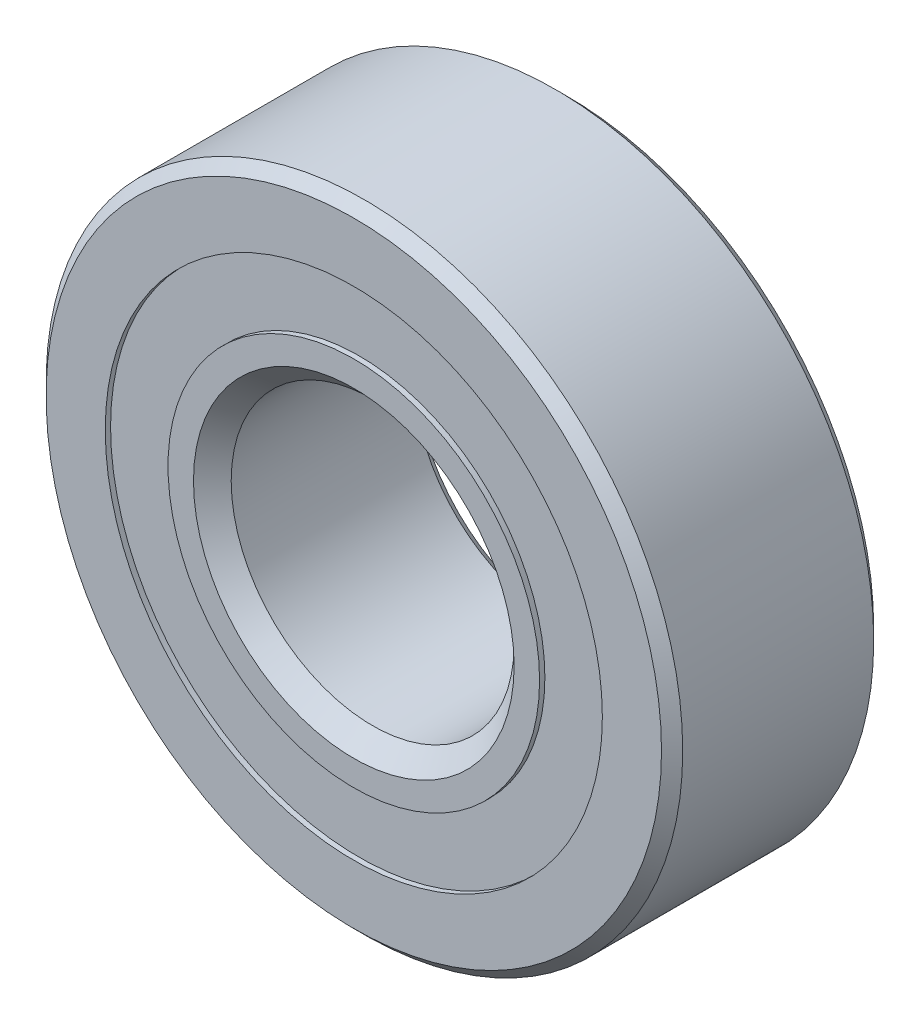
ISO-10303-21;
HEADER;
FILE_DESCRIPTION(('STEP AP214'),'2;1');
FILE_NAME('part.step','',(''),(''),'','','');
FILE_SCHEMA(('AUTOMOTIVE_DESIGN { 1 0 10303 214 1 1 1 1 }'));
ENDSEC;
DATA;
#1=APPLICATION_CONTEXT('core data for automotive mechanical design processes');
#2=APPLICATION_PROTOCOL_DEFINITION('international standard','automotive_design',2000,#1);
#3=PRODUCT_CONTEXT('',#1,'mechanical');
#4=PRODUCT('Part','Part','',(#3));
#5=PRODUCT_RELATED_PRODUCT_CATEGORY('part','',(#4));
#6=PRODUCT_DEFINITION_FORMATION('','',#4);
#7=PRODUCT_DEFINITION_CONTEXT('part definition',#1,'design');
#8=PRODUCT_DEFINITION('design','',#6,#7);
#9=PRODUCT_DEFINITION_SHAPE('','',#8);
#10=(LENGTH_UNIT() NAMED_UNIT(*) SI_UNIT(.MILLI.,.METRE.));
#11=(NAMED_UNIT(*) PLANE_ANGLE_UNIT() SI_UNIT($,.RADIAN.));
#12=(NAMED_UNIT(*) SI_UNIT($,.STERADIAN.) SOLID_ANGLE_UNIT());
#13=UNCERTAINTY_MEASURE_WITH_UNIT(LENGTH_MEASURE(1.E-05),#10,'distance_accuracy_value','');
#14=(GEOMETRIC_REPRESENTATION_CONTEXT(3) GLOBAL_UNCERTAINTY_ASSIGNED_CONTEXT((#13)) GLOBAL_UNIT_ASSIGNED_CONTEXT((#10,
#11,#12)) REPRESENTATION_CONTEXT('',''));
#15=CARTESIAN_POINT('',(0.,0.,0.));
#16=DIRECTION('',(0.,0.,1.));
#17=DIRECTION('',(1.,0.,0.));
#18=AXIS2_PLACEMENT_3D('',#15,#16,#17);
#19=CARTESIAN_POINT('',(0.,11.1561126373626,-4.524375));
#20=DIRECTION('',(0.,0.,1.));
#21=DIRECTION('',(1.,0.,0.));
#22=AXIS2_PLACEMENT_3D('',#19,#20,#21);
#23=PLANE('',#22);
#24=CARTESIAN_POINT('',(0.,0.,-4.524375));
#25=DIRECTION('',(0.,0.,1.));
#26=DIRECTION('',(1.,0.,0.));
#27=AXIS2_PLACEMENT_3D('',#24,#25,#26);
#28=CIRCLE('',#27,11.1561126373626);
#29=CARTESIAN_POINT('',(11.1561126373626,0.,-4.524375));
#30=VERTEX_POINT('',#29);
#31=EDGE_CURVE('E63',#30,#30,#28,.T.);
#32=ORIENTED_EDGE('',*,*,#31,.F.);
#33=EDGE_LOOP('',(#32));
#34=FACE_BOUND('',#33,.T.);
#35=CARTESIAN_POINT('',(0.,0.,-4.524375));
#36=DIRECTION('',(0.,0.,1.));
#37=DIRECTION('',(1.,0.,0.));
#38=AXIS2_PLACEMENT_3D('',#35,#36,#37);
#39=CIRCLE('',#38,8.33881099868363);
#40=CARTESIAN_POINT('',(8.33881099868363,0.,-4.524375));
#41=VERTEX_POINT('',#40);
#42=EDGE_CURVE('E11',#41,#41,#39,.T.);
#43=ORIENTED_EDGE('',*,*,#42,.T.);
#44=EDGE_LOOP('',(#43));
#45=FACE_BOUND('',#44,.T.);
#46=ADVANCED_FACE('F49',(#34,#45),#23,.F.);
#47=CARTESIAN_POINT('',(0.,0.,4.7625));
#48=DIRECTION('',(0.,0.,1.));
#49=DIRECTION('',(1.,0.,0.));
#50=AXIS2_PLACEMENT_3D('',#47,#48,#49);
#51=CYLINDRICAL_SURFACE('',#50,8.33881099868363);
#52=ORIENTED_EDGE('',*,*,#42,.F.);
#53=EDGE_LOOP('',(#52));
#54=FACE_BOUND('',#53,.T.);
#55=CARTESIAN_POINT('',(0.,0.,-2.27628073054021));
#56=DIRECTION('',(0.,0.,1.));
#57=DIRECTION('',(1.,0.,0.));
#58=AXIS2_PLACEMENT_3D('',#55,#56,#57);
#59=CIRCLE('',#58,8.33881099868363);
#60=CARTESIAN_POINT('',(8.33881099868363,0.,-2.27628073054021));
#61=VERTEX_POINT('',#60);
#62=EDGE_CURVE('E55',#61,#61,#59,.T.);
#63=ORIENTED_EDGE('',*,*,#62,.T.);
#64=EDGE_LOOP('',(#63));
#65=FACE_BOUND('',#64,.T.);
#66=ADVANCED_FACE('F72',(#54,#65),#51,.F.);
#67=CARTESIAN_POINT('',(0.,11.1561126373626,-2.27628073054021));
#68=DIRECTION('',(0.,0.,-1.));
#69=DIRECTION('',(-1.,0.,0.));
#70=AXIS2_PLACEMENT_3D('',#67,#68,#69);
#71=PLANE('',#70);
#72=ORIENTED_EDGE('',*,*,#62,.F.);
#73=EDGE_LOOP('',(#72));
#74=FACE_BOUND('',#73,.T.);
#75=CARTESIAN_POINT('',(0.,0.,-2.27628073054021));
#76=DIRECTION('',(0.,0.,1.));
#77=DIRECTION('',(1.,0.,0.));
#78=AXIS2_PLACEMENT_3D('',#75,#76,#77);
#79=CIRCLE('',#78,11.1561126373626);
#80=CARTESIAN_POINT('',(11.1561126373626,0.,-2.27628073054021));
#81=VERTEX_POINT('',#80);
#82=EDGE_CURVE('E59',#81,#81,#79,.T.);
#83=ORIENTED_EDGE('',*,*,#82,.T.);
#84=EDGE_LOOP('',(#83));
#85=FACE_BOUND('',#84,.T.);
#86=ADVANCED_FACE('F76',(#74,#85),#71,.F.);
#87=CARTESIAN_POINT('',(0.,0.,4.7625));
#88=DIRECTION('',(0.,0.,1.));
#89=DIRECTION('',(1.,0.,0.));
#90=AXIS2_PLACEMENT_3D('',#87,#88,#89);
#91=CYLINDRICAL_SURFACE('',#90,11.1561126373626);
#92=ORIENTED_EDGE('',*,*,#82,.F.);
#93=EDGE_LOOP('',(#92));
#94=FACE_BOUND('',#93,.T.);
#95=ORIENTED_EDGE('',*,*,#31,.T.);
#96=EDGE_LOOP('',(#95));
#97=FACE_BOUND('',#96,.T.);
#98=ADVANCED_FACE('F69',(#94,#97),#91,.T.);
#99=CLOSED_SHELL('',(#46,#66,#86,#98));
#100=MANIFOLD_SOLID_BREP('B2',#99);
#101=CARTESIAN_POINT('',(0.,11.1561126373626,4.524375));
#102=DIRECTION('',(0.,0.,-1.));
#103=DIRECTION('',(-1.,0.,0.));
#104=AXIS2_PLACEMENT_3D('',#101,#102,#103);
#105=PLANE('',#104);
#106=CARTESIAN_POINT('',(0.,0.,4.524375));
#107=DIRECTION('',(0.,0.,1.));
#108=DIRECTION('',(1.,0.,0.));
#109=AXIS2_PLACEMENT_3D('',#106,#107,#108);
#110=CIRCLE('',#109,8.33881099868363);
#111=CARTESIAN_POINT('',(8.33881099868363,0.,4.524375));
#112=VERTEX_POINT('',#111);
#113=EDGE_CURVE('E48',#112,#112,#110,.T.);
#114=ORIENTED_EDGE('',*,*,#113,.F.);
#115=EDGE_LOOP('',(#114));
#116=FACE_BOUND('',#115,.T.);
#117=CARTESIAN_POINT('',(0.,0.,4.524375));
#118=DIRECTION('',(0.,0.,1.));
#119=DIRECTION('',(1.,0.,0.));
#120=AXIS2_PLACEMENT_3D('',#117,#118,#119);
#121=CIRCLE('',#120,11.1561126373626);
#122=CARTESIAN_POINT('',(11.1561126373626,0.,4.524375));
#123=VERTEX_POINT('',#122);
#124=EDGE_CURVE('E130',#123,#123,#121,.T.);
#125=ORIENTED_EDGE('',*,*,#124,.T.);
#126=EDGE_LOOP('',(#125));
#127=FACE_BOUND('',#126,.T.);
#128=ADVANCED_FACE('F116',(#116,#127),#105,.F.);
#129=CARTESIAN_POINT('',(0.,0.,4.7625));
#130=DIRECTION('',(0.,0.,1.));
#131=DIRECTION('',(1.,0.,0.));
#132=AXIS2_PLACEMENT_3D('',#129,#130,#131);
#133=CYLINDRICAL_SURFACE('',#132,8.33881099868363);
#134=CARTESIAN_POINT('',(0.,0.,2.27628073054021));
#135=DIRECTION('',(0.,0.,1.));
#136=DIRECTION('',(1.,0.,0.));
#137=AXIS2_PLACEMENT_3D('',#134,#135,#136);
#138=CIRCLE('',#137,8.33881099868363);
#139=CARTESIAN_POINT('',(8.33881099868363,0.,2.27628073054021));
#140=VERTEX_POINT('',#139);
#141=EDGE_CURVE('E122',#140,#140,#138,.T.);
#142=ORIENTED_EDGE('',*,*,#141,.F.);
#143=EDGE_LOOP('',(#142));
#144=FACE_BOUND('',#143,.T.);
#145=ORIENTED_EDGE('',*,*,#113,.T.);
#146=EDGE_LOOP('',(#145));
#147=FACE_BOUND('',#146,.T.);
#148=ADVANCED_FACE('F145',(#144,#147),#133,.F.);
#149=CARTESIAN_POINT('',(0.,11.1561126373626,2.27628073054021));
#150=DIRECTION('',(0.,0.,1.));
#151=DIRECTION('',(1.,0.,0.));
#152=AXIS2_PLACEMENT_3D('',#149,#150,#151);
#153=PLANE('',#152);
#154=CARTESIAN_POINT('',(0.,0.,2.27628073054021));
#155=DIRECTION('',(0.,0.,1.));
#156=DIRECTION('',(1.,0.,0.));
#157=AXIS2_PLACEMENT_3D('',#154,#155,#156);
#158=CIRCLE('',#157,11.1561126373626);
#159=CARTESIAN_POINT('',(11.1561126373626,0.,2.27628073054021));
#160=VERTEX_POINT('',#159);
#161=EDGE_CURVE('E126',#160,#160,#158,.T.);
#162=ORIENTED_EDGE('',*,*,#161,.F.);
#163=EDGE_LOOP('',(#162));
#164=FACE_BOUND('',#163,.T.);
#165=ORIENTED_EDGE('',*,*,#141,.T.);
#166=EDGE_LOOP('',(#165));
#167=FACE_BOUND('',#166,.T.);
#168=ADVANCED_FACE('F140',(#164,#167),#153,.F.);
#169=CARTESIAN_POINT('',(0.,0.,4.7625));
#170=DIRECTION('',(0.,0.,1.));
#171=DIRECTION('',(1.,0.,0.));
#172=AXIS2_PLACEMENT_3D('',#169,#170,#171);
#173=CYLINDRICAL_SURFACE('',#172,11.1561126373626);
#174=ORIENTED_EDGE('',*,*,#124,.F.);
#175=EDGE_LOOP('',(#174));
#176=FACE_BOUND('',#175,.T.);
#177=ORIENTED_EDGE('',*,*,#161,.T.);
#178=EDGE_LOOP('',(#177));
#179=FACE_BOUND('',#178,.T.);
#180=ADVANCED_FACE('F137',(#176,#179),#173,.T.);
#181=CLOSED_SHELL('',(#128,#148,#168,#180));
#182=MANIFOLD_SOLID_BREP('B6',#181);
#183=CARTESIAN_POINT('',(-6.06520907209285,8.34804411070657,0.));
#184=DIRECTION('',(0.,0.,1.));
#185=DIRECTION('',(-0.587785252292462,0.809016994374955,0.));
#186=AXIS2_PLACEMENT_3D('',#183,#184,#185);
#187=SPHERICAL_SURFACE('',#186,2.27628073054021);
#188=CARTESIAN_POINT('',(-6.06520907209285,8.34804411070657,2.27628073054021));
#189=VERTEX_POINT('',#188);
#190=VERTEX_LOOP('',#189);
#191=FACE_BOUND('',#190,.T.);
#192=ADVANCED_FACE('F201',(#191),#187,.T.);
#193=CLOSED_SHELL('',(#192));
#194=MANIFOLD_SOLID_BREP('B43',#193);
#195=CARTESIAN_POINT('',(-9.81371442752058,3.1886691107066,0.));
#196=DIRECTION('',(0.,0.,1.));
#197=DIRECTION('',(-0.95105651629515,0.309016994374958,0.));
#198=AXIS2_PLACEMENT_3D('',#195,#196,#197);
#199=SPHERICAL_SURFACE('',#198,2.27628073054021);
#200=CARTESIAN_POINT('',(-9.81371442752058,3.1886691107066,2.27628073054021));
#201=VERTEX_POINT('',#200);
#202=VERTEX_LOOP('',#201);
#203=FACE_BOUND('',#202,.T.);
#204=ADVANCED_FACE('F237',(#203),#199,.T.);
#205=CLOSED_SHELL('',(#204));
#206=MANIFOLD_SOLID_BREP('B112',#205);
#207=CARTESIAN_POINT('',(-9.81371442752065,-3.18866911070639,0.));
#208=DIRECTION('',(0.,0.,1.));
#209=DIRECTION('',(-0.951056516295157,-0.309016994374938,0.));
#210=AXIS2_PLACEMENT_3D('',#207,#208,#209);
#211=SPHERICAL_SURFACE('',#210,2.27628073054021);
#212=CARTESIAN_POINT('',(-9.81371442752065,-3.18866911070639,2.27628073054021));
#213=VERTEX_POINT('',#212);
#214=VERTEX_LOOP('',#213);
#215=FACE_BOUND('',#214,.T.);
#216=ADVANCED_FACE('F273',(#215),#211,.T.);
#217=CLOSED_SHELL('',(#216));
#218=MANIFOLD_SOLID_BREP('B197',#217);
#219=CARTESIAN_POINT('',(-6.06520907209303,-8.34804411070643,0.));
#220=DIRECTION('',(0.,0.,1.));
#221=DIRECTION('',(-0.58778525229248,-0.809016994374942,0.));
#222=AXIS2_PLACEMENT_3D('',#219,#220,#221);
#223=SPHERICAL_SURFACE('',#222,2.27628073054021);
#224=CARTESIAN_POINT('',(-6.06520907209303,-8.34804411070643,2.27628073054021));
#225=VERTEX_POINT('',#224);
#226=VERTEX_LOOP('',#225);
#227=FACE_BOUND('',#226,.T.);
#228=ADVANCED_FACE('F307',(#227),#223,.T.);
#229=CLOSED_SHELL('',(#228));
#230=MANIFOLD_SOLID_BREP('B233',#229);
#231=CARTESIAN_POINT('',(0.,-10.31875,0.));
#232=DIRECTION('',(0.,0.,1.));
#233=DIRECTION('',(0.,-1.,0.));
#234=AXIS2_PLACEMENT_3D('',#231,#232,#233);
#235=SPHERICAL_SURFACE('',#234,2.27628073054021);
#236=CARTESIAN_POINT('',(0.,-10.31875,2.27628073054021));
#237=VERTEX_POINT('',#236);
#238=VERTEX_LOOP('',#237);
#239=FACE_BOUND('',#238,.T.);
#240=ADVANCED_FACE('F341',(#239),#235,.T.);
#241=CLOSED_SHELL('',(#240));
#242=MANIFOLD_SOLID_BREP('B269',#241);
#243=CARTESIAN_POINT('',(6.06520907209291,-8.34804411070652,0.));
#244=DIRECTION('',(0.,0.,1.));
#245=DIRECTION('',(0.587785252292469,-0.809016994374951,0.));
#246=AXIS2_PLACEMENT_3D('',#243,#244,#245);
#247=SPHERICAL_SURFACE('',#246,2.27628073054021);
#248=CARTESIAN_POINT('',(6.06520907209291,-8.34804411070652,2.27628073054021));
#249=VERTEX_POINT('',#248);
#250=VERTEX_LOOP('',#249);
#251=FACE_BOUND('',#250,.T.);
#252=ADVANCED_FACE('F377',(#251),#247,.T.);
#253=CLOSED_SHELL('',(#252));
#254=MANIFOLD_SOLID_BREP('B303',#253);
#255=CARTESIAN_POINT('',(9.8137144275206,-3.18866911070653,0.));
#256=DIRECTION('',(0.,0.,1.));
#257=DIRECTION('',(0.951056516295152,-0.309016994374952,0.));
#258=AXIS2_PLACEMENT_3D('',#255,#256,#257);
#259=SPHERICAL_SURFACE('',#258,2.27628073054021);
#260=CARTESIAN_POINT('',(9.8137144275206,-3.18866911070653,2.27628073054021));
#261=VERTEX_POINT('',#260);
#262=VERTEX_LOOP('',#261);
#263=FACE_BOUND('',#262,.T.);
#264=ADVANCED_FACE('F411',(#263),#259,.T.);
#265=CLOSED_SHELL('',(#264));
#266=MANIFOLD_SOLID_BREP('B337',#265);
#267=CARTESIAN_POINT('',(9.81371442752063,3.18866911070646,0.));
#268=DIRECTION('',(0.,0.,1.));
#269=DIRECTION('',(0.951056516295155,0.309016994374945,0.));
#270=AXIS2_PLACEMENT_3D('',#267,#268,#269);
#271=SPHERICAL_SURFACE('',#270,2.27628073054021);
#272=CARTESIAN_POINT('',(9.81371442752063,3.18866911070646,2.27628073054021));
#273=VERTEX_POINT('',#272);
#274=VERTEX_LOOP('',#273);
#275=FACE_BOUND('',#274,.T.);
#276=ADVANCED_FACE('F445',(#275),#271,.T.);
#277=CLOSED_SHELL('',(#276));
#278=MANIFOLD_SOLID_BREP('B373',#277);
#279=CARTESIAN_POINT('',(6.06520907209297,8.34804411070648,0.));
#280=DIRECTION('',(0.,0.,1.));
#281=DIRECTION('',(0.587785252292474,0.809016994374947,0.));
#282=AXIS2_PLACEMENT_3D('',#279,#280,#281);
#283=SPHERICAL_SURFACE('',#282,2.27628073054021);
#284=CARTESIAN_POINT('',(6.06520907209297,8.34804411070648,2.27628073054021));
#285=VERTEX_POINT('',#284);
#286=VERTEX_LOOP('',#285);
#287=FACE_BOUND('',#286,.T.);
#288=ADVANCED_FACE('F481',(#287),#283,.T.);
#289=CLOSED_SHELL('',(#288));
#290=MANIFOLD_SOLID_BREP('B407',#289);
#291=CARTESIAN_POINT('',(0.,10.31875,0.));
#292=DIRECTION('',(0.,0.,1.));
#293=DIRECTION('',(0.,1.,0.));
#294=AXIS2_PLACEMENT_3D('',#291,#292,#293);
#295=SPHERICAL_SURFACE('',#294,2.27628073054021);
#296=CARTESIAN_POINT('',(0.,10.31875,2.27628073054021));
#297=VERTEX_POINT('',#296);
#298=VERTEX_LOOP('',#297);
#299=FACE_BOUND('',#298,.T.);
#300=ADVANCED_FACE('F519',(#299),#295,.T.);
#301=CLOSED_SHELL('',(#300));
#302=MANIFOLD_SOLID_BREP('B441',#301);
#303=CARTESIAN_POINT('',(0.,0.,4.7625));
#304=DIRECTION('',(0.,0.,1.));
#305=DIRECTION('',(1.,0.,0.));
#306=AXIS2_PLACEMENT_3D('',#303,#304,#305);
#307=CYLINDRICAL_SURFACE('',#306,8.33881099868363);
#308=CARTESIAN_POINT('',(0.,0.,4.7625));
#309=DIRECTION('',(0.,0.,1.));
#310=DIRECTION('',(1.,0.,0.));
#311=AXIS2_PLACEMENT_3D('',#308,#309,#310);
#312=CIRCLE('',#311,8.33881099868363);
#313=CARTESIAN_POINT('',(8.33881099868363,0.,4.7625));
#314=VERTEX_POINT('',#313);
#315=EDGE_CURVE('E578',#314,#314,#312,.T.);
#316=ORIENTED_EDGE('',*,*,#315,.F.);
#317=EDGE_LOOP('',(#316));
#318=FACE_BOUND('',#317,.T.);
#319=CARTESIAN_POINT('',(0.,0.,4.524375));
#320=DIRECTION('',(0.,0.,1.));
#321=DIRECTION('',(1.,0.,0.));
#322=AXIS2_PLACEMENT_3D('',#319,#320,#321);
#323=CIRCLE('',#322,8.33881099868363);
#324=CARTESIAN_POINT('',(8.33881099868363,0.,4.524375));
#325=VERTEX_POINT('',#324);
#326=EDGE_CURVE('E518',#325,#325,#323,.T.);
#327=ORIENTED_EDGE('',*,*,#326,.T.);
#328=EDGE_LOOP('',(#327));
#329=FACE_BOUND('',#328,.T.);
#330=ADVANCED_FACE('F538',(#318,#329),#307,.T.);
#331=CARTESIAN_POINT('',(0.,8.33881099868363,4.524375));
#332=DIRECTION('',(0.,0.,1.));
#333=DIRECTION('',(1.,0.,0.));
#334=AXIS2_PLACEMENT_3D('',#331,#332,#333);
#335=PLANE('',#334);
#336=ORIENTED_EDGE('',*,*,#326,.F.);
#337=EDGE_LOOP('',(#336));
#338=FACE_BOUND('',#337,.T.);
#339=CARTESIAN_POINT('',(0.,0.,4.524375));
#340=DIRECTION('',(0.,0.,1.));
#341=DIRECTION('',(1.,0.,0.));
#342=AXIS2_PLACEMENT_3D('',#339,#340,#341);
#343=CIRCLE('',#342,8.10068599868363);
#344=CARTESIAN_POINT('',(8.10068599868363,0.,4.524375));
#345=VERTEX_POINT('',#344);
#346=EDGE_CURVE('E544',#345,#345,#343,.T.);
#347=ORIENTED_EDGE('',*,*,#346,.T.);
#348=EDGE_LOOP('',(#347));
#349=FACE_BOUND('',#348,.T.);
#350=ADVANCED_FACE('F585',(#338,#349),#335,.F.);
#351=CARTESIAN_POINT('',(0.,0.,3.61992363604627));
#352=DIRECTION('',(0.,0.,1.));
#353=DIRECTION('',(1.,0.,0.));
#354=AXIS2_PLACEMENT_3D('',#351,#352,#353);
#355=CONICAL_SURFACE('',#354,7.19623463472989,0.78539816339745);
#356=ORIENTED_EDGE('',*,*,#346,.F.);
#357=EDGE_LOOP('',(#356));
#358=FACE_BOUND('',#357,.T.);
#359=CARTESIAN_POINT('',(0.,0.,3.61992363604627));
#360=DIRECTION('',(0.,0.,1.));
#361=DIRECTION('',(1.,0.,0.));
#362=AXIS2_PLACEMENT_3D('',#359,#360,#361);
#363=CIRCLE('',#362,7.19623463472989);
#364=CARTESIAN_POINT('',(7.19623463472989,0.,3.61992363604627));
#365=VERTEX_POINT('',#364);
#366=EDGE_CURVE('E548',#365,#365,#363,.T.);
#367=ORIENTED_EDGE('',*,*,#366,.T.);
#368=EDGE_LOOP('',(#367));
#369=FACE_BOUND('',#368,.T.);
#370=ADVANCED_FACE('F589',(#358,#369),#355,.T.);
#371=CARTESIAN_POINT('',(0.,0.,4.7625));
#372=DIRECTION('',(0.,0.,1.));
#373=DIRECTION('',(1.,0.,0.));
#374=AXIS2_PLACEMENT_3D('',#371,#372,#373);
#375=CYLINDRICAL_SURFACE('',#374,7.19623463472989);
#376=ORIENTED_EDGE('',*,*,#366,.F.);
#377=EDGE_LOOP('',(#376));
#378=FACE_BOUND('',#377,.T.);
#379=CARTESIAN_POINT('',(0.,0.,0.));
#380=DIRECTION('',(0.,0.,1.));
#381=DIRECTION('',(1.,0.,0.));
#382=AXIS2_PLACEMENT_3D('',#379,#380,#381);
#383=CIRCLE('',#382,7.19623463472989);
#384=CARTESIAN_POINT('',(7.19623463472989,0.,0.));
#385=VERTEX_POINT('',#384);
#386=EDGE_CURVE('E552',#385,#385,#383,.T.);
#387=ORIENTED_EDGE('',*,*,#386,.T.);
#388=EDGE_LOOP('',(#387));
#389=FACE_BOUND('',#388,.T.);
#390=ADVANCED_FACE('F594',(#378,#389),#375,.T.);
#391=CARTESIAN_POINT('',(0.,7.19623463472989,0.));
#392=DIRECTION('',(0.,0.,-1.));
#393=DIRECTION('',(-1.,0.,0.));
#394=AXIS2_PLACEMENT_3D('',#391,#392,#393);
#395=PLANE('',#394);
#396=ORIENTED_EDGE('',*,*,#386,.F.);
#397=EDGE_LOOP('',(#396));
#398=FACE_BOUND('',#397,.T.);
#399=CARTESIAN_POINT('',(0.,0.,0.));
#400=DIRECTION('',(0.,0.,1.));
#401=DIRECTION('',(1.,0.,0.));
#402=AXIS2_PLACEMENT_3D('',#399,#400,#401);
#403=CIRCLE('',#402,8.04246926945979);
#404=CARTESIAN_POINT('',(8.04246926945979,0.,0.));
#405=VERTEX_POINT('',#404);
#406=EDGE_CURVE('E557',#405,#405,#403,.T.);
#407=ORIENTED_EDGE('',*,*,#406,.T.);
#408=EDGE_LOOP('',(#407));
#409=FACE_BOUND('',#408,.T.);
#410=ADVANCED_FACE('F600',(#398,#409),#395,.F.);
#411=CARTESIAN_POINT('',(0.,0.,0.));
#412=DIRECTION('',(0.,0.,1.));
#413=DIRECTION('',(1.,0.,0.));
#414=AXIS2_PLACEMENT_3D('',#411,#412,#413);
#415=TOROIDAL_SURFACE('',#414,10.31875,2.27628073054021);
#416=ORIENTED_EDGE('',*,*,#406,.F.);
#417=EDGE_LOOP('',(#416));
#418=FACE_BOUND('',#417,.T.);
#419=CARTESIAN_POINT('',(0.,0.,-2.11666666666666));
#420=DIRECTION('',(0.,0.,1.));
#421=DIRECTION('',(1.,0.,0.));
#422=AXIS2_PLACEMENT_3D('',#419,#420,#421);
#423=CIRCLE('',#422,9.48138736263736);
#424=CARTESIAN_POINT('',(9.48138736263736,0.,-2.11666666666666));
#425=VERTEX_POINT('',#424);
#426=EDGE_CURVE('E560',#425,#425,#423,.T.);
#427=ORIENTED_EDGE('',*,*,#426,.T.);
#428=EDGE_LOOP('',(#427));
#429=FACE_BOUND('',#428,.T.);
#430=ADVANCED_FACE('F604',(#418,#429),#415,.F.);
#431=CARTESIAN_POINT('',(0.,0.,4.7625));
#432=DIRECTION('',(0.,0.,1.));
#433=DIRECTION('',(1.,0.,0.));
#434=AXIS2_PLACEMENT_3D('',#431,#432,#433);
#435=CYLINDRICAL_SURFACE('',#434,9.48138736263736);
#436=ORIENTED_EDGE('',*,*,#426,.F.);
#437=EDGE_LOOP('',(#436));
#438=FACE_BOUND('',#437,.T.);
#439=CARTESIAN_POINT('',(0.,0.,-4.7625));
#440=DIRECTION('',(0.,0.,1.));
#441=DIRECTION('',(1.,0.,0.));
#442=AXIS2_PLACEMENT_3D('',#439,#440,#441);
#443=CIRCLE('',#442,9.48138736263736);
#444=CARTESIAN_POINT('',(9.48138736263736,0.,-4.7625));
#445=VERTEX_POINT('',#444);
#446=EDGE_CURVE('E563',#445,#445,#443,.T.);
#447=ORIENTED_EDGE('',*,*,#446,.T.);
#448=EDGE_LOOP('',(#447));
#449=FACE_BOUND('',#448,.T.);
#450=ADVANCED_FACE('F608',(#438,#449),#435,.T.);
#451=CARTESIAN_POINT('',(0.,6.82624999999999,-4.7625));
#452=DIRECTION('',(0.,0.,1.));
#453=DIRECTION('',(1.,0.,0.));
#454=AXIS2_PLACEMENT_3D('',#451,#452,#453);
#455=PLANE('',#454);
#456=ORIENTED_EDGE('',*,*,#446,.F.);
#457=EDGE_LOOP('',(#456));
#458=FACE_BOUND('',#457,.T.);
#459=CARTESIAN_POINT('',(0.,0.,-4.7625));
#460=DIRECTION('',(0.,0.,1.));
#461=DIRECTION('',(1.,0.,0.));
#462=AXIS2_PLACEMENT_3D('',#459,#460,#461);
#463=CIRCLE('',#462,6.82624999999999);
#464=CARTESIAN_POINT('',(6.82624999999999,0.,-4.7625));
#465=VERTEX_POINT('',#464);
#466=EDGE_CURVE('E566',#465,#465,#463,.T.);
#467=ORIENTED_EDGE('',*,*,#466,.T.);
#468=EDGE_LOOP('',(#467));
#469=FACE_BOUND('',#468,.T.);
#470=ADVANCED_FACE('F612',(#458,#469),#455,.F.);
#471=CARTESIAN_POINT('',(0.,0.,-4.28625));
#472=DIRECTION('',(0.,0.,-1.));
#473=DIRECTION('',(-1.,0.,0.));
#474=AXIS2_PLACEMENT_3D('',#471,#472,#473);
#475=CONICAL_SURFACE('',#474,6.35,0.785398163397445);
#476=ORIENTED_EDGE('',*,*,#466,.F.);
#477=EDGE_LOOP('',(#476));
#478=FACE_BOUND('',#477,.T.);
#479=CARTESIAN_POINT('',(0.,0.,-4.28625));
#480=DIRECTION('',(0.,0.,1.));
#481=DIRECTION('',(1.,0.,0.));
#482=AXIS2_PLACEMENT_3D('',#479,#480,#481);
#483=CIRCLE('',#482,6.35);
#484=CARTESIAN_POINT('',(6.35,0.,-4.28625));
#485=VERTEX_POINT('',#484);
#486=EDGE_CURVE('E569',#485,#485,#483,.T.);
#487=ORIENTED_EDGE('',*,*,#486,.T.);
#488=EDGE_LOOP('',(#487));
#489=FACE_BOUND('',#488,.T.);
#490=ADVANCED_FACE('F616',(#478,#489),#475,.F.);
#491=CARTESIAN_POINT('',(0.,0.,4.7625));
#492=DIRECTION('',(0.,0.,1.));
#493=DIRECTION('',(1.,0.,0.));
#494=AXIS2_PLACEMENT_3D('',#491,#492,#493);
#495=CYLINDRICAL_SURFACE('',#494,6.35);
#496=ORIENTED_EDGE('',*,*,#486,.F.);
#497=EDGE_LOOP('',(#496));
#498=FACE_BOUND('',#497,.T.);
#499=CARTESIAN_POINT('',(0.,0.,3.91626536527011));
#500=DIRECTION('',(0.,0.,1.));
#501=DIRECTION('',(1.,0.,0.));
#502=AXIS2_PLACEMENT_3D('',#499,#500,#501);
#503=CIRCLE('',#502,6.35);
#504=CARTESIAN_POINT('',(6.35,0.,3.91626536527011));
#505=VERTEX_POINT('',#504);
#506=EDGE_CURVE('E572',#505,#505,#503,.T.);
#507=ORIENTED_EDGE('',*,*,#506,.T.);
#508=EDGE_LOOP('',(#507));
#509=FACE_BOUND('',#508,.T.);
#510=ADVANCED_FACE('F620',(#498,#509),#495,.F.);
#511=CARTESIAN_POINT('',(0.,0.,4.7625));
#512=DIRECTION('',(0.,0.,1.));
#513=DIRECTION('',(1.,0.,0.));
#514=AXIS2_PLACEMENT_3D('',#511,#512,#513);
#515=CONICAL_SURFACE('',#514,7.19623463472989,0.785398163397449);
#516=ORIENTED_EDGE('',*,*,#506,.F.);
#517=EDGE_LOOP('',(#516));
#518=FACE_BOUND('',#517,.T.);
#519=CARTESIAN_POINT('',(0.,0.,4.7625));
#520=DIRECTION('',(0.,0.,1.));
#521=DIRECTION('',(1.,0.,0.));
#522=AXIS2_PLACEMENT_3D('',#519,#520,#521);
#523=CIRCLE('',#522,7.19623463472989);
#524=CARTESIAN_POINT('',(7.19623463472989,0.,4.7625));
#525=VERTEX_POINT('',#524);
#526=EDGE_CURVE('E575',#525,#525,#523,.T.);
#527=ORIENTED_EDGE('',*,*,#526,.T.);
#528=EDGE_LOOP('',(#527));
#529=FACE_BOUND('',#528,.T.);
#530=ADVANCED_FACE('F624',(#518,#529),#515,.F.);
#531=CARTESIAN_POINT('',(0.,8.33881099868363,4.7625));
#532=DIRECTION('',(0.,0.,-1.));
#533=DIRECTION('',(-1.,0.,0.));
#534=AXIS2_PLACEMENT_3D('',#531,#532,#533);
#535=PLANE('',#534);
#536=ORIENTED_EDGE('',*,*,#526,.F.);
#537=EDGE_LOOP('',(#536));
#538=FACE_BOUND('',#537,.T.);
#539=ORIENTED_EDGE('',*,*,#315,.T.);
#540=EDGE_LOOP('',(#539));
#541=FACE_BOUND('',#540,.T.);
#542=ADVANCED_FACE('F582',(#538,#541),#535,.F.);
#543=CLOSED_SHELL('',(#330,#350,#370,#390,#410,#430,#450,#470,#490,#510,#530,#542));
#544=MANIFOLD_SOLID_BREP('B477',#543);
#545=CARTESIAN_POINT('',(0.,0.,4.28625));
#546=DIRECTION('',(0.,0.,-1.));
#547=DIRECTION('',(-1.,0.,0.));
#548=AXIS2_PLACEMENT_3D('',#545,#546,#547);
#549=CONICAL_SURFACE('',#548,14.2875,0.785398163397443);
#550=CARTESIAN_POINT('',(0.,0.,4.7625));
#551=DIRECTION('',(0.,0.,1.));
#552=DIRECTION('',(1.,0.,0.));
#553=AXIS2_PLACEMENT_3D('',#550,#551,#552);
#554=CIRCLE('',#553,13.81125);
#555=CARTESIAN_POINT('',(13.81125,0.,4.7625));
#556=VERTEX_POINT('',#555);
#557=EDGE_CURVE('E754',#556,#556,#554,.T.);
#558=ORIENTED_EDGE('',*,*,#557,.F.);
#559=EDGE_LOOP('',(#558));
#560=FACE_BOUND('',#559,.T.);
#561=CARTESIAN_POINT('',(0.,0.,4.28625));
#562=DIRECTION('',(0.,0.,1.));
#563=DIRECTION('',(1.,0.,0.));
#564=AXIS2_PLACEMENT_3D('',#561,#562,#563);
#565=CIRCLE('',#564,14.2875);
#566=CARTESIAN_POINT('',(14.2875,0.,4.28625));
#567=VERTEX_POINT('',#566);
#568=EDGE_CURVE('E537',#567,#567,#565,.T.);
#569=ORIENTED_EDGE('',*,*,#568,.T.);
#570=EDGE_LOOP('',(#569));
#571=FACE_BOUND('',#570,.T.);
#572=ADVANCED_FACE('F719',(#560,#571),#549,.T.);
#573=CARTESIAN_POINT('',(0.,0.,4.7625));
#574=DIRECTION('',(0.,0.,1.));
#575=DIRECTION('',(1.,0.,0.));
#576=AXIS2_PLACEMENT_3D('',#573,#574,#575);
#577=CYLINDRICAL_SURFACE('',#576,14.2875);
#578=ORIENTED_EDGE('',*,*,#568,.F.);
#579=EDGE_LOOP('',(#578));
#580=FACE_BOUND('',#579,.T.);
#581=CARTESIAN_POINT('',(0.,0.,-4.28625));
#582=DIRECTION('',(0.,0.,1.));
#583=DIRECTION('',(1.,0.,0.));
#584=AXIS2_PLACEMENT_3D('',#581,#582,#583);
#585=CIRCLE('',#584,14.2875);
#586=CARTESIAN_POINT('',(14.2875,0.,-4.28625));
#587=VERTEX_POINT('',#586);
#588=EDGE_CURVE('E726',#587,#587,#585,.T.);
#589=ORIENTED_EDGE('',*,*,#588,.T.);
#590=EDGE_LOOP('',(#589));
#591=FACE_BOUND('',#590,.T.);
#592=ADVANCED_FACE('F762',(#580,#591),#577,.T.);
#593=CARTESIAN_POINT('',(0.,0.,-4.7625));
#594=DIRECTION('',(0.,0.,1.));
#595=DIRECTION('',(1.,0.,0.));
#596=AXIS2_PLACEMENT_3D('',#593,#594,#595);
#597=CONICAL_SURFACE('',#596,13.81125,0.785398163397445);
#598=ORIENTED_EDGE('',*,*,#588,.F.);
#599=EDGE_LOOP('',(#598));
#600=FACE_BOUND('',#599,.T.);
#601=CARTESIAN_POINT('',(0.,0.,-4.7625));
#602=DIRECTION('',(0.,0.,1.));
#603=DIRECTION('',(1.,0.,0.));
#604=AXIS2_PLACEMENT_3D('',#601,#602,#603);
#605=CIRCLE('',#604,13.81125);
#606=CARTESIAN_POINT('',(13.81125,0.,-4.7625));
#607=VERTEX_POINT('',#606);
#608=EDGE_CURVE('E731',#607,#607,#605,.T.);
#609=ORIENTED_EDGE('',*,*,#608,.T.);
#610=EDGE_LOOP('',(#609));
#611=FACE_BOUND('',#610,.T.);
#612=ADVANCED_FACE('F766',(#600,#611),#597,.T.);
#613=CARTESIAN_POINT('',(0.,13.81125,-4.7625));
#614=DIRECTION('',(0.,0.,1.));
#615=DIRECTION('',(1.,0.,0.));
#616=AXIS2_PLACEMENT_3D('',#613,#614,#615);
#617=PLANE('',#616);
#618=ORIENTED_EDGE('',*,*,#608,.F.);
#619=EDGE_LOOP('',(#618));
#620=FACE_BOUND('',#619,.T.);
#621=CARTESIAN_POINT('',(0.,0.,-4.76250000000001));
#622=DIRECTION('',(0.,0.,1.));
#623=DIRECTION('',(1.,0.,0.));
#624=AXIS2_PLACEMENT_3D('',#621,#622,#623);
#625=CIRCLE('',#624,11.1561126373626);
#626=CARTESIAN_POINT('',(11.1561126373626,0.,-4.76250000000001));
#627=VERTEX_POINT('',#626);
#628=EDGE_CURVE('E736',#627,#627,#625,.T.);
#629=ORIENTED_EDGE('',*,*,#628,.T.);
#630=EDGE_LOOP('',(#629));
#631=FACE_BOUND('',#630,.T.);
#632=ADVANCED_FACE('F771',(#620,#631),#617,.F.);
#633=CARTESIAN_POINT('',(0.,0.,4.7625));
#634=DIRECTION('',(0.,0.,1.));
#635=DIRECTION('',(1.,0.,0.));
#636=AXIS2_PLACEMENT_3D('',#633,#634,#635);
#637=CYLINDRICAL_SURFACE('',#636,11.1561126373626);
#638=ORIENTED_EDGE('',*,*,#628,.F.);
#639=EDGE_LOOP('',(#638));
#640=FACE_BOUND('',#639,.T.);
#641=CARTESIAN_POINT('',(0.,0.,-2.11666666666667));
#642=DIRECTION('',(0.,0.,1.));
#643=DIRECTION('',(1.,0.,0.));
#644=AXIS2_PLACEMENT_3D('',#641,#642,#643);
#645=CIRCLE('',#644,11.1561126373626);
#646=CARTESIAN_POINT('',(11.1561126373626,0.,-2.11666666666667));
#647=VERTEX_POINT('',#646);
#648=EDGE_CURVE('E742',#647,#647,#645,.T.);
#649=ORIENTED_EDGE('',*,*,#648,.T.);
#650=EDGE_LOOP('',(#649));
#651=FACE_BOUND('',#650,.T.);
#652=ADVANCED_FACE('F777',(#640,#651),#637,.F.);
#653=CARTESIAN_POINT('',(0.,0.,0.));
#654=DIRECTION('',(0.,0.,1.));
#655=DIRECTION('',(1.,0.,0.));
#656=AXIS2_PLACEMENT_3D('',#653,#654,#655);
#657=TOROIDAL_SURFACE('',#656,10.31875,2.27628073054021);
#658=ORIENTED_EDGE('',*,*,#648,.F.);
#659=EDGE_LOOP('',(#658));
#660=FACE_BOUND('',#659,.T.);
#661=CARTESIAN_POINT('',(0.,0.,2.11666666666667));
#662=DIRECTION('',(0.,0.,1.));
#663=DIRECTION('',(1.,0.,0.));
#664=AXIS2_PLACEMENT_3D('',#661,#662,#663);
#665=CIRCLE('',#664,11.1561126373626);
#666=CARTESIAN_POINT('',(11.1561126373626,0.,2.11666666666667));
#667=VERTEX_POINT('',#666);
#668=EDGE_CURVE('E746',#667,#667,#665,.T.);
#669=ORIENTED_EDGE('',*,*,#668,.T.);
#670=EDGE_LOOP('',(#669));
#671=FACE_BOUND('',#670,.T.);
#672=ADVANCED_FACE('F781',(#660,#671),#657,.F.);
#673=CARTESIAN_POINT('',(0.,0.,4.7625));
#674=DIRECTION('',(0.,0.,1.));
#675=DIRECTION('',(1.,0.,0.));
#676=AXIS2_PLACEMENT_3D('',#673,#674,#675);
#677=CYLINDRICAL_SURFACE('',#676,11.1561126373626);
#678=ORIENTED_EDGE('',*,*,#668,.F.);
#679=EDGE_LOOP('',(#678));
#680=FACE_BOUND('',#679,.T.);
#681=CARTESIAN_POINT('',(0.,0.,4.7625));
#682=DIRECTION('',(0.,0.,1.));
#683=DIRECTION('',(1.,0.,0.));
#684=AXIS2_PLACEMENT_3D('',#681,#682,#683);
#685=CIRCLE('',#684,11.1561126373626);
#686=CARTESIAN_POINT('',(11.1561126373626,0.,4.7625));
#687=VERTEX_POINT('',#686);
#688=EDGE_CURVE('E750',#687,#687,#685,.T.);
#689=ORIENTED_EDGE('',*,*,#688,.T.);
#690=EDGE_LOOP('',(#689));
#691=FACE_BOUND('',#690,.T.);
#692=ADVANCED_FACE('F785',(#680,#691),#677,.F.);
#693=CARTESIAN_POINT('',(0.,13.81125,4.7625));
#694=DIRECTION('',(0.,0.,-1.));
#695=DIRECTION('',(-1.,0.,0.));
#696=AXIS2_PLACEMENT_3D('',#693,#694,#695);
#697=PLANE('',#696);
#698=ORIENTED_EDGE('',*,*,#688,.F.);
#699=EDGE_LOOP('',(#698));
#700=FACE_BOUND('',#699,.T.);
#701=ORIENTED_EDGE('',*,*,#557,.T.);
#702=EDGE_LOOP('',(#701));
#703=FACE_BOUND('',#702,.T.);
#704=ADVANCED_FACE('F759',(#700,#703),#697,.F.);
#705=CLOSED_SHELL('',(#572,#592,#612,#632,#652,#672,#692,#704));
#706=MANIFOLD_SOLID_BREP('B513',#705);
#707=ADVANCED_BREP_SHAPE_REPRESENTATION('',(#18,#100,#182,#194,#206,#218,#230,#242,#254,#266,
#278,#290,#302,#544,#706),#14);
#708=SHAPE_DEFINITION_REPRESENTATION(#9,#707);
ENDSEC;
END-ISO-10303-21;
